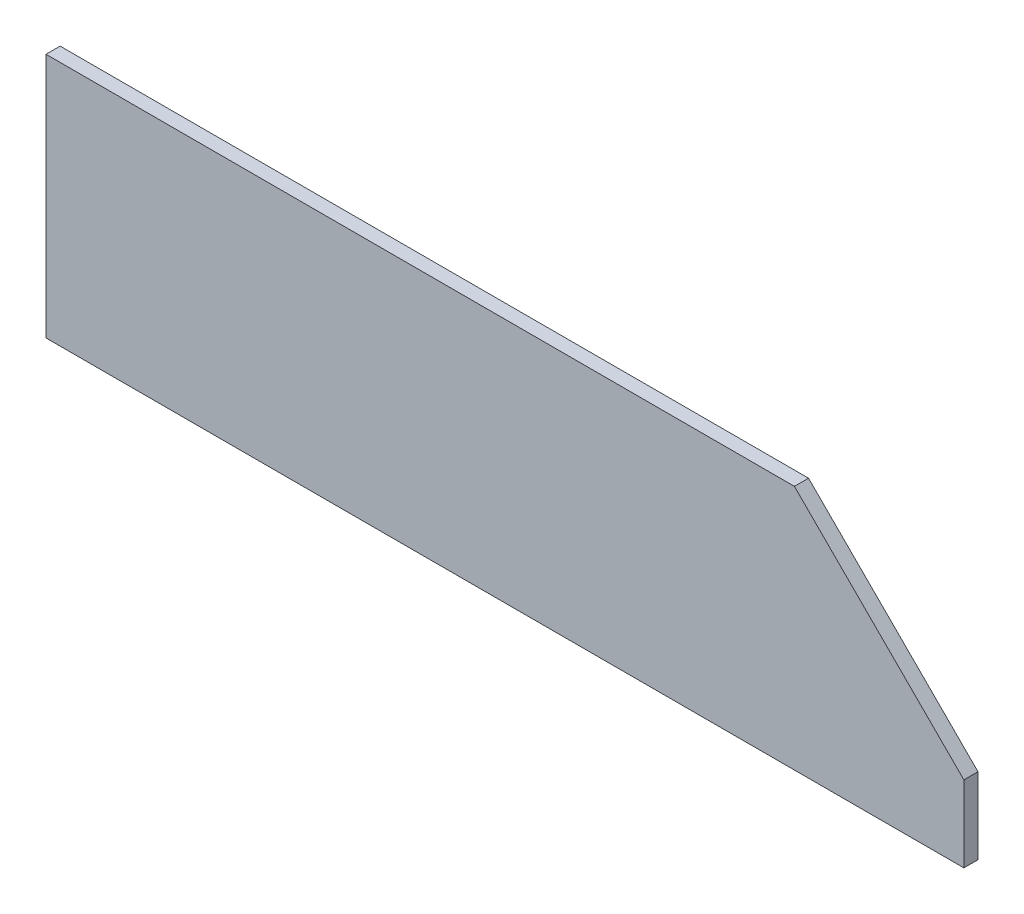
ISO-10303-21;
HEADER;
FILE_DESCRIPTION(('STEP AP214'),'2;1');
FILE_NAME('part.step','',(''),(''),'','','');
FILE_SCHEMA(('AUTOMOTIVE_DESIGN { 1 0 10303 214 1 1 1 1 }'));
ENDSEC;
DATA;
#1=APPLICATION_CONTEXT('core data for automotive mechanical design processes');
#2=APPLICATION_PROTOCOL_DEFINITION('international standard','automotive_design',2000,#1);
#3=PRODUCT_CONTEXT('',#1,'mechanical');
#4=PRODUCT('Part','Part','',(#3));
#5=PRODUCT_RELATED_PRODUCT_CATEGORY('part','',(#4));
#6=PRODUCT_DEFINITION_FORMATION('','',#4);
#7=PRODUCT_DEFINITION_CONTEXT('part definition',#1,'design');
#8=PRODUCT_DEFINITION('design','',#6,#7);
#9=PRODUCT_DEFINITION_SHAPE('','',#8);
#10=(LENGTH_UNIT() NAMED_UNIT(*) SI_UNIT(.MILLI.,.METRE.));
#11=(NAMED_UNIT(*) PLANE_ANGLE_UNIT() SI_UNIT($,.RADIAN.));
#12=(NAMED_UNIT(*) SI_UNIT($,.STERADIAN.) SOLID_ANGLE_UNIT());
#13=UNCERTAINTY_MEASURE_WITH_UNIT(LENGTH_MEASURE(1.E-05),#10,'distance_accuracy_value','');
#14=(GEOMETRIC_REPRESENTATION_CONTEXT(3) GLOBAL_UNCERTAINTY_ASSIGNED_CONTEXT((#13)) GLOBAL_UNIT_ASSIGNED_CONTEXT((#10,
#11,#12)) REPRESENTATION_CONTEXT('',''));
#15=CARTESIAN_POINT('',(0.,0.,0.));
#16=DIRECTION('',(0.,0.,1.));
#17=DIRECTION('',(1.,0.,0.));
#18=AXIS2_PLACEMENT_3D('',#15,#16,#17);
#19=CARTESIAN_POINT('',(162.5,87.,-2.5));
#20=DIRECTION('',(-1.,0.,0.));
#21=DIRECTION('',(0.,0.,1.));
#22=AXIS2_PLACEMENT_3D('',#19,#20,#21);
#23=PLANE('',#22);
#24=DIRECTION('',(0.,-1.,0.));
#25=VECTOR('',#24,1.);
#26=CARTESIAN_POINT('',(162.5,87.,-2.5));
#27=LINE('',#26,#25);
#28=CARTESIAN_POINT('',(162.5,26.9999999999998,-2.5));
#29=VERTEX_POINT('',#28);
#30=CARTESIAN_POINT('',(162.5,0.,-2.5));
#31=VERTEX_POINT('',#30);
#32=EDGE_CURVE('E110',#29,#31,#27,.T.);
#33=ORIENTED_EDGE('',*,*,#32,.F.);
#34=DIRECTION('',(0.,0.,1.));
#35=VECTOR('',#34,1.);
#36=CARTESIAN_POINT('',(162.5,26.9999999999998,2.5));
#37=LINE('',#36,#35);
#38=CARTESIAN_POINT('',(162.5,26.9999999999998,2.5));
#39=VERTEX_POINT('',#38);
#40=EDGE_CURVE('E54',#29,#39,#37,.T.);
#41=ORIENTED_EDGE('',*,*,#40,.T.);
#42=DIRECTION('',(0.,-1.,0.));
#43=VECTOR('',#42,1.);
#44=CARTESIAN_POINT('',(162.5,87.,2.5));
#45=LINE('',#44,#43);
#46=CARTESIAN_POINT('',(162.5,0.,2.5));
#47=VERTEX_POINT('',#46);
#48=EDGE_CURVE('E120',#39,#47,#45,.T.);
#49=ORIENTED_EDGE('',*,*,#48,.T.);
#50=DIRECTION('',(0.,0.,-1.));
#51=VECTOR('',#50,1.);
#52=CARTESIAN_POINT('',(162.5,0.,-2.5));
#53=LINE('',#52,#51);
#54=EDGE_CURVE('E123',#47,#31,#53,.T.);
#55=ORIENTED_EDGE('',*,*,#54,.T.);
#56=EDGE_LOOP('',(#33,#41,#49,#55));
#57=FACE_BOUND('',#56,.T.);
#58=ADVANCED_FACE('F44',(#57),#23,.F.);
#59=CARTESIAN_POINT('',(-162.5,87.,-2.5));
#60=DIRECTION('',(0.,0.,1.));
#61=DIRECTION('',(1.,0.,0.));
#62=AXIS2_PLACEMENT_3D('',#59,#60,#61);
#63=PLANE('',#62);
#64=DIRECTION('',(-1.,0.,0.));
#65=VECTOR('',#64,1.);
#66=CARTESIAN_POINT('',(-162.5,87.,-2.5));
#67=LINE('',#66,#65);
#68=CARTESIAN_POINT('',(102.5,87.,-2.5));
#69=VERTEX_POINT('',#68);
#70=CARTESIAN_POINT('',(-162.5,87.,-2.5));
#71=VERTEX_POINT('',#70);
#72=EDGE_CURVE('E90',#69,#71,#67,.T.);
#73=ORIENTED_EDGE('',*,*,#72,.F.);
#74=DIRECTION('',(0.707106781186546,-0.707106781186549,0.));
#75=VECTOR('',#74,1.);
#76=CARTESIAN_POINT('',(102.5,87.,-2.5));
#77=LINE('',#76,#75);
#78=EDGE_CURVE('E68',#69,#29,#77,.T.);
#79=ORIENTED_EDGE('',*,*,#78,.T.);
#80=ORIENTED_EDGE('',*,*,#32,.T.);
#81=DIRECTION('',(-1.,0.,0.));
#82=VECTOR('',#81,1.);
#83=CARTESIAN_POINT('',(-162.5,0.,-2.5));
#84=LINE('',#83,#82);
#85=CARTESIAN_POINT('',(-162.5,0.,-2.5));
#86=VERTEX_POINT('',#85);
#87=EDGE_CURVE('E106',#31,#86,#84,.T.);
#88=ORIENTED_EDGE('',*,*,#87,.T.);
#89=DIRECTION('',(0.,-1.,0.));
#90=VECTOR('',#89,1.);
#91=CARTESIAN_POINT('',(-162.5,87.,-2.5));
#92=LINE('',#91,#90);
#93=EDGE_CURVE('E103',#71,#86,#92,.T.);
#94=ORIENTED_EDGE('',*,*,#93,.F.);
#95=EDGE_LOOP('',(#73,#79,#80,#88,#94));
#96=FACE_BOUND('',#95,.T.);
#97=ADVANCED_FACE('F104',(#96),#63,.F.);
#98=CARTESIAN_POINT('',(-162.5,87.,-2.5));
#99=DIRECTION('',(1.,0.,0.));
#100=DIRECTION('',(0.,0.,-1.));
#101=AXIS2_PLACEMENT_3D('',#98,#99,#100);
#102=PLANE('',#101);
#103=DIRECTION('',(0.,0.,1.));
#104=VECTOR('',#103,1.);
#105=CARTESIAN_POINT('',(-162.5,0.,-2.5));
#106=LINE('',#105,#104);
#107=CARTESIAN_POINT('',(-162.5,0.,2.5));
#108=VERTEX_POINT('',#107);
#109=EDGE_CURVE('E129',#86,#108,#106,.T.);
#110=ORIENTED_EDGE('',*,*,#109,.T.);
#111=DIRECTION('',(0.,-1.,0.));
#112=VECTOR('',#111,1.);
#113=CARTESIAN_POINT('',(-162.5,87.,2.5));
#114=LINE('',#113,#112);
#115=CARTESIAN_POINT('',(-162.5,87.,2.5));
#116=VERTEX_POINT('',#115);
#117=EDGE_CURVE('E111',#116,#108,#114,.T.);
#118=ORIENTED_EDGE('',*,*,#117,.F.);
#119=DIRECTION('',(0.,0.,1.));
#120=VECTOR('',#119,1.);
#121=CARTESIAN_POINT('',(-162.5,87.,-2.5));
#122=LINE('',#121,#120);
#123=EDGE_CURVE('E95',#71,#116,#122,.T.);
#124=ORIENTED_EDGE('',*,*,#123,.F.);
#125=ORIENTED_EDGE('',*,*,#93,.T.);
#126=EDGE_LOOP('',(#110,#118,#124,#125));
#127=FACE_BOUND('',#126,.T.);
#128=ADVANCED_FACE('F113',(#127),#102,.F.);
#129=CARTESIAN_POINT('',(-162.5,87.,2.5));
#130=DIRECTION('',(0.,0.,-1.));
#131=DIRECTION('',(-1.,0.,0.));
#132=AXIS2_PLACEMENT_3D('',#129,#130,#131);
#133=PLANE('',#132);
#134=ORIENTED_EDGE('',*,*,#48,.F.);
#135=DIRECTION('',(-0.707106781186546,0.707106781186549,0.));
#136=VECTOR('',#135,1.);
#137=CARTESIAN_POINT('',(102.5,87.,2.5));
#138=LINE('',#137,#136);
#139=CARTESIAN_POINT('',(102.5,87.,2.5));
#140=VERTEX_POINT('',#139);
#141=EDGE_CURVE('E11',#39,#140,#138,.T.);
#142=ORIENTED_EDGE('',*,*,#141,.T.);
#143=DIRECTION('',(1.,0.,0.));
#144=VECTOR('',#143,1.);
#145=CARTESIAN_POINT('',(-162.5,87.,2.5));
#146=LINE('',#145,#144);
#147=EDGE_CURVE('E117',#116,#140,#146,.T.);
#148=ORIENTED_EDGE('',*,*,#147,.F.);
#149=ORIENTED_EDGE('',*,*,#117,.T.);
#150=DIRECTION('',(1.,0.,0.));
#151=VECTOR('',#150,1.);
#152=CARTESIAN_POINT('',(-162.5,0.,2.5));
#153=LINE('',#152,#151);
#154=EDGE_CURVE('E100',#108,#47,#153,.T.);
#155=ORIENTED_EDGE('',*,*,#154,.T.);
#156=EDGE_LOOP('',(#134,#142,#148,#149,#155));
#157=FACE_BOUND('',#156,.T.);
#158=ADVANCED_FACE('F151',(#157),#133,.F.);
#159=CARTESIAN_POINT('',(0.,87.,0.));
#160=DIRECTION('',(0.,1.,0.));
#161=DIRECTION('',(0.,0.,1.));
#162=AXIS2_PLACEMENT_3D('',#159,#160,#161);
#163=PLANE('',#162);
#164=ORIENTED_EDGE('',*,*,#147,.T.);
#165=DIRECTION('',(0.,0.,-1.));
#166=VECTOR('',#165,1.);
#167=CARTESIAN_POINT('',(102.5,87.,-2.5));
#168=LINE('',#167,#166);
#169=EDGE_CURVE('E98',#140,#69,#168,.T.);
#170=ORIENTED_EDGE('',*,*,#169,.T.);
#171=ORIENTED_EDGE('',*,*,#72,.T.);
#172=ORIENTED_EDGE('',*,*,#123,.T.);
#173=EDGE_LOOP('',(#164,#170,#171,#172));
#174=FACE_BOUND('',#173,.T.);
#175=ADVANCED_FACE('F93',(#174),#163,.T.);
#176=CARTESIAN_POINT('',(0.,0.,0.));
#177=DIRECTION('',(0.,1.,0.));
#178=DIRECTION('',(0.,0.,1.));
#179=AXIS2_PLACEMENT_3D('',#176,#177,#178);
#180=PLANE('',#179);
#181=ORIENTED_EDGE('',*,*,#54,.F.);
#182=ORIENTED_EDGE('',*,*,#154,.F.);
#183=ORIENTED_EDGE('',*,*,#109,.F.);
#184=ORIENTED_EDGE('',*,*,#87,.F.);
#185=EDGE_LOOP('',(#181,#182,#183,#184));
#186=FACE_BOUND('',#185,.T.);
#187=ADVANCED_FACE('F147',(#186),#180,.F.);
#188=CARTESIAN_POINT('',(102.5,87.,0.));
#189=DIRECTION('',(0.707106781186549,0.707106781186546,0.));
#190=DIRECTION('',(0.,0.,1.));
#191=AXIS2_PLACEMENT_3D('',#188,#189,#190);
#192=PLANE('',#191);
#193=ORIENTED_EDGE('',*,*,#141,.F.);
#194=ORIENTED_EDGE('',*,*,#40,.F.);
#195=ORIENTED_EDGE('',*,*,#78,.F.);
#196=ORIENTED_EDGE('',*,*,#169,.F.);
#197=EDGE_LOOP('',(#193,#194,#195,#196));
#198=FACE_BOUND('',#197,.T.);
#199=ADVANCED_FACE('F47',(#198),#192,.T.);
#200=CLOSED_SHELL('',(#58,#97,#128,#158,#175,#187,#199));
#201=MANIFOLD_SOLID_BREP('B2',#200);
#202=ADVANCED_BREP_SHAPE_REPRESENTATION('',(#18,#201),#14);
#203=SHAPE_DEFINITION_REPRESENTATION(#9,#202);
ENDSEC;
END-ISO-10303-21;
